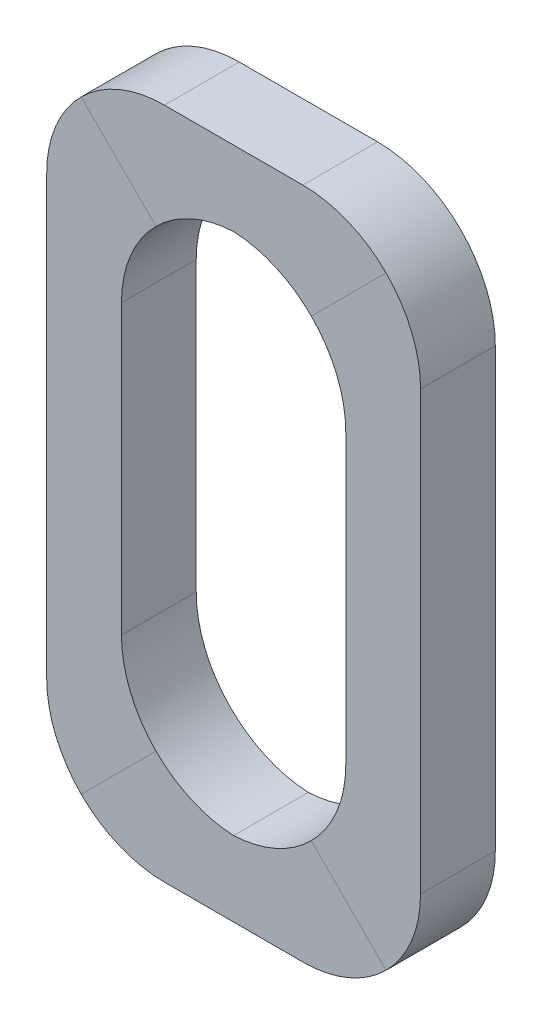
ISO-10303-21;
HEADER;
FILE_DESCRIPTION(('STEP AP214'),'2;1');
FILE_NAME('part.step','',(''),(''),'','','');
FILE_SCHEMA(('AUTOMOTIVE_DESIGN { 1 0 10303 214 1 1 1 1 }'));
ENDSEC;
DATA;
#1=APPLICATION_CONTEXT('core data for automotive mechanical design processes');
#2=APPLICATION_PROTOCOL_DEFINITION('international standard','automotive_design',2000,#1);
#3=PRODUCT_CONTEXT('',#1,'mechanical');
#4=PRODUCT('Part','Part','',(#3));
#5=PRODUCT_RELATED_PRODUCT_CATEGORY('part','',(#4));
#6=PRODUCT_DEFINITION_FORMATION('','',#4);
#7=PRODUCT_DEFINITION_CONTEXT('part definition',#1,'design');
#8=PRODUCT_DEFINITION('design','',#6,#7);
#9=PRODUCT_DEFINITION_SHAPE('','',#8);
#10=(LENGTH_UNIT() NAMED_UNIT(*) SI_UNIT(.MILLI.,.METRE.));
#11=(NAMED_UNIT(*) PLANE_ANGLE_UNIT() SI_UNIT($,.RADIAN.));
#12=(NAMED_UNIT(*) SI_UNIT($,.STERADIAN.) SOLID_ANGLE_UNIT());
#13=UNCERTAINTY_MEASURE_WITH_UNIT(LENGTH_MEASURE(1.E-05),#10,'distance_accuracy_value','');
#14=(GEOMETRIC_REPRESENTATION_CONTEXT(3) GLOBAL_UNCERTAINTY_ASSIGNED_CONTEXT((#13)) GLOBAL_UNIT_ASSIGNED_CONTEXT((#10,
#11,#12)) REPRESENTATION_CONTEXT('',''));
#15=CARTESIAN_POINT('',(0.,0.,0.));
#16=DIRECTION('',(0.,0.,1.));
#17=DIRECTION('',(1.,0.,0.));
#18=AXIS2_PLACEMENT_3D('',#15,#16,#17);
#19=CARTESIAN_POINT('',(28.575,54.3925,3.175));
#20=DIRECTION('',(0.,0.,1.));
#21=DIRECTION('',(1.,0.,0.));
#22=AXIS2_PLACEMENT_3D('',#19,#20,#21);
#23=PLANE('',#22);
#24=DIRECTION('',(0.707106781186548,-0.707106781186548,0.));
#25=VECTOR('',#24,1.);
#26=CARTESIAN_POINT('',(28.78375,-3.38374999999999,3.175));
#27=LINE('',#26,#25);
#28=CARTESIAN_POINT('',(19.2960678118655,6.10393218813454,3.175));
#29=VERTEX_POINT('',#28);
#30=CARTESIAN_POINT('',(25.6460678118655,-0.246067811865467,3.175));
#31=VERTEX_POINT('',#30);
#32=EDGE_CURVE('E251',#29,#31,#27,.T.);
#33=ORIENTED_EDGE('',*,*,#32,.T.);
#34=CARTESIAN_POINT('',(18.575,6.82500000000001,3.175));
#35=DIRECTION('',(0.,0.,1.));
#36=DIRECTION('',(1.,0.,0.));
#37=AXIS2_PLACEMENT_3D('',#34,#35,#36);
#38=CIRCLE('',#37,10.);
#39=CARTESIAN_POINT('',(28.575,6.82500000000001,3.175));
#40=VERTEX_POINT('',#39);
#41=EDGE_CURVE('E11',#31,#40,#38,.T.);
#42=ORIENTED_EDGE('',*,*,#41,.T.);
#43=DIRECTION('',(0.,-1.,0.));
#44=VECTOR('',#43,1.);
#45=CARTESIAN_POINT('',(28.575,54.3925,3.175));
#46=LINE('',#45,#44);
#47=CARTESIAN_POINT('',(28.575,43.975,3.175));
#48=VERTEX_POINT('',#47);
#49=EDGE_CURVE('E262',#48,#40,#46,.T.);
#50=ORIENTED_EDGE('',*,*,#49,.F.);
#51=CARTESIAN_POINT('',(18.575,43.975,3.175));
#52=DIRECTION('',(0.,0.,1.));
#53=DIRECTION('',(1.,0.,0.));
#54=AXIS2_PLACEMENT_3D('',#51,#52,#53);
#55=CIRCLE('',#54,10.);
#56=CARTESIAN_POINT('',(25.6460678118655,51.0460678118655,3.175));
#57=VERTEX_POINT('',#56);
#58=EDGE_CURVE('E47',#48,#57,#55,.T.);
#59=ORIENTED_EDGE('',*,*,#58,.T.);
#60=DIRECTION('',(0.707106781186548,0.707106781186548,0.));
#61=VECTOR('',#60,1.);
#62=CARTESIAN_POINT('',(12.49125,37.89125,3.175));
#63=LINE('',#62,#61);
#64=CARTESIAN_POINT('',(19.2960678118655,44.6960678118655,3.175));
#65=VERTEX_POINT('',#64);
#66=EDGE_CURVE('E234',#65,#57,#63,.T.);
#67=ORIENTED_EDGE('',*,*,#66,.F.);
#68=CARTESIAN_POINT('',(12.225,37.625,3.175));
#69=DIRECTION('',(0.,0.,1.));
#70=DIRECTION('',(1.,0.,0.));
#71=AXIS2_PLACEMENT_3D('',#68,#69,#70);
#72=CIRCLE('',#71,10.);
#73=CARTESIAN_POINT('',(22.225,37.625,3.175));
#74=VERTEX_POINT('',#73);
#75=EDGE_CURVE('E311',#65,#74,#72,.F.);
#76=ORIENTED_EDGE('',*,*,#75,.T.);
#77=DIRECTION('',(0.,-1.,0.));
#78=VECTOR('',#77,1.);
#79=CARTESIAN_POINT('',(22.225,54.3925,3.175));
#80=LINE('',#79,#78);
#81=CARTESIAN_POINT('',(22.225,13.175,3.175));
#82=VERTEX_POINT('',#81);
#83=EDGE_CURVE('E255',#74,#82,#80,.T.);
#84=ORIENTED_EDGE('',*,*,#83,.T.);
#85=CARTESIAN_POINT('',(12.225,13.175,3.175));
#86=DIRECTION('',(0.,0.,1.));
#87=DIRECTION('',(1.,0.,0.));
#88=AXIS2_PLACEMENT_3D('',#85,#86,#87);
#89=CIRCLE('',#88,10.);
#90=EDGE_CURVE('E293',#82,#29,#89,.F.);
#91=ORIENTED_EDGE('',*,*,#90,.T.);
#92=EDGE_LOOP('',(#33,#42,#50,#59,#67,#76,#84,#91));
#93=FACE_BOUND('',#92,.T.);
#94=ADVANCED_FACE('F38',(#93),#23,.T.);
#95=CARTESIAN_POINT('',(28.575,54.3925,3.175));
#96=DIRECTION('',(1.,0.,0.));
#97=DIRECTION('',(0.,0.,-1.));
#98=AXIS2_PLACEMENT_3D('',#95,#96,#97);
#99=PLANE('',#98);
#100=ORIENTED_EDGE('',*,*,#49,.T.);
#101=DIRECTION('',(0.,0.,-1.));
#102=VECTOR('',#101,1.);
#103=CARTESIAN_POINT('',(28.575,6.82500000000001,3.175));
#104=LINE('',#103,#102);
#105=CARTESIAN_POINT('',(28.575,6.82500000000001,-3.175));
#106=VERTEX_POINT('',#105);
#107=EDGE_CURVE('E400',#40,#106,#104,.T.);
#108=ORIENTED_EDGE('',*,*,#107,.T.);
#109=DIRECTION('',(0.,-1.,0.));
#110=VECTOR('',#109,1.);
#111=CARTESIAN_POINT('',(28.575,54.3925,-3.175));
#112=LINE('',#111,#110);
#113=CARTESIAN_POINT('',(28.575,43.975,-3.175));
#114=VERTEX_POINT('',#113);
#115=EDGE_CURVE('E266',#114,#106,#112,.T.);
#116=ORIENTED_EDGE('',*,*,#115,.F.);
#117=DIRECTION('',(0.,0.,-1.));
#118=VECTOR('',#117,1.);
#119=CARTESIAN_POINT('',(28.575,43.975,3.175));
#120=LINE('',#119,#118);
#121=EDGE_CURVE('E397',#114,#48,#120,.F.);
#122=ORIENTED_EDGE('',*,*,#121,.T.);
#123=EDGE_LOOP('',(#100,#108,#116,#122));
#124=FACE_BOUND('',#123,.T.);
#125=ADVANCED_FACE('F496',(#124),#99,.T.);
#126=CARTESIAN_POINT('',(28.575,54.3925,-3.175));
#127=DIRECTION('',(0.,0.,-1.));
#128=DIRECTION('',(-1.,0.,0.));
#129=AXIS2_PLACEMENT_3D('',#126,#127,#128);
#130=PLANE('',#129);
#131=ORIENTED_EDGE('',*,*,#115,.T.);
#132=CARTESIAN_POINT('',(18.575,6.82500000000001,-3.175));
#133=DIRECTION('',(0.,0.,-1.));
#134=DIRECTION('',(-1.,0.,0.));
#135=AXIS2_PLACEMENT_3D('',#132,#133,#134);
#136=CIRCLE('',#135,10.);
#137=CARTESIAN_POINT('',(25.6460678118655,-0.246067811865467,-3.175));
#138=VERTEX_POINT('',#137);
#139=EDGE_CURVE('E54',#106,#138,#136,.T.);
#140=ORIENTED_EDGE('',*,*,#139,.T.);
#141=DIRECTION('',(-0.707106781186548,0.707106781186548,0.));
#142=VECTOR('',#141,1.);
#143=CARTESIAN_POINT('',(28.78375,-3.38374999999999,-3.175));
#144=LINE('',#143,#142);
#145=CARTESIAN_POINT('',(19.2960678118655,6.10393218813454,-3.175));
#146=VERTEX_POINT('',#145);
#147=EDGE_CURVE('E247',#138,#146,#144,.T.);
#148=ORIENTED_EDGE('',*,*,#147,.T.);
#149=CARTESIAN_POINT('',(12.225,13.175,-3.175));
#150=DIRECTION('',(0.,0.,-1.));
#151=DIRECTION('',(-1.,0.,0.));
#152=AXIS2_PLACEMENT_3D('',#149,#150,#151);
#153=CIRCLE('',#152,10.);
#154=CARTESIAN_POINT('',(22.225,13.175,-3.175));
#155=VERTEX_POINT('',#154);
#156=EDGE_CURVE('E304',#146,#155,#153,.F.);
#157=ORIENTED_EDGE('',*,*,#156,.T.);
#158=DIRECTION('',(0.,-1.,0.));
#159=VECTOR('',#158,1.);
#160=CARTESIAN_POINT('',(22.225,54.3925,-3.175));
#161=LINE('',#160,#159);
#162=CARTESIAN_POINT('',(22.225,37.625,-3.175));
#163=VERTEX_POINT('',#162);
#164=EDGE_CURVE('E270',#163,#155,#161,.T.);
#165=ORIENTED_EDGE('',*,*,#164,.F.);
#166=CARTESIAN_POINT('',(12.225,37.625,-3.175));
#167=DIRECTION('',(0.,0.,-1.));
#168=DIRECTION('',(-1.,0.,0.));
#169=AXIS2_PLACEMENT_3D('',#166,#167,#168);
#170=CIRCLE('',#169,10.);
#171=CARTESIAN_POINT('',(19.2960678118655,44.6960678118655,-3.175));
#172=VERTEX_POINT('',#171);
#173=EDGE_CURVE('E314',#163,#172,#170,.F.);
#174=ORIENTED_EDGE('',*,*,#173,.T.);
#175=DIRECTION('',(-0.707106781186548,-0.707106781186548,0.));
#176=VECTOR('',#175,1.);
#177=CARTESIAN_POINT('',(12.49125,37.89125,-3.175));
#178=LINE('',#177,#176);
#179=CARTESIAN_POINT('',(25.6460678118655,51.0460678118655,-3.175));
#180=VERTEX_POINT('',#179);
#181=EDGE_CURVE('E230',#180,#172,#178,.T.);
#182=ORIENTED_EDGE('',*,*,#181,.F.);
#183=CARTESIAN_POINT('',(18.575,43.975,-3.175));
#184=DIRECTION('',(0.,0.,-1.));
#185=DIRECTION('',(-1.,0.,0.));
#186=AXIS2_PLACEMENT_3D('',#183,#184,#185);
#187=CIRCLE('',#186,10.);
#188=EDGE_CURVE('E62',#180,#114,#187,.T.);
#189=ORIENTED_EDGE('',*,*,#188,.T.);
#190=EDGE_LOOP('',(#131,#140,#148,#157,#165,#174,#182,#189));
#191=FACE_BOUND('',#190,.T.);
#192=ADVANCED_FACE('F494',(#191),#130,.T.);
#193=CARTESIAN_POINT('',(22.225,54.3925,3.175));
#194=DIRECTION('',(-1.,0.,0.));
#195=DIRECTION('',(0.,0.,1.));
#196=AXIS2_PLACEMENT_3D('',#193,#194,#195);
#197=PLANE('',#196);
#198=ORIENTED_EDGE('',*,*,#164,.T.);
#199=DIRECTION('',(0.,0.,1.));
#200=VECTOR('',#199,1.);
#201=CARTESIAN_POINT('',(22.225,13.175,3.175));
#202=LINE('',#201,#200);
#203=EDGE_CURVE('E282',#155,#82,#202,.T.);
#204=ORIENTED_EDGE('',*,*,#203,.T.);
#205=ORIENTED_EDGE('',*,*,#83,.F.);
#206=DIRECTION('',(0.,0.,1.));
#207=VECTOR('',#206,1.);
#208=CARTESIAN_POINT('',(22.225,37.625,-3.175));
#209=LINE('',#208,#207);
#210=EDGE_CURVE('E213',#74,#163,#209,.F.);
#211=ORIENTED_EDGE('',*,*,#210,.T.);
#212=EDGE_LOOP('',(#198,#204,#205,#211));
#213=FACE_BOUND('',#212,.T.);
#214=ADVANCED_FACE('F491',(#213),#197,.T.);
#215=CARTESIAN_POINT('',(28.9925,-3.17499999999999,3.175));
#216=DIRECTION('',(0.,0.,1.));
#217=DIRECTION('',(1.,0.,0.));
#218=AXIS2_PLACEMENT_3D('',#215,#216,#217);
#219=PLANE('',#218);
#220=DIRECTION('',(-0.707106781186548,-0.707106781186548,0.));
#221=VECTOR('',#220,1.);
#222=CARTESIAN_POINT('',(-3.38375,-3.38375,3.175));
#223=LINE('',#222,#221);
#224=CARTESIAN_POINT('',(6.10393218813453,6.10393218813453,3.175));
#225=VERTEX_POINT('',#224);
#226=CARTESIAN_POINT('',(-0.246067811865472,-0.246067811865471,3.175));
#227=VERTEX_POINT('',#226);
#228=EDGE_CURVE('E233',#225,#227,#223,.T.);
#229=ORIENTED_EDGE('',*,*,#228,.T.);
#230=CARTESIAN_POINT('',(6.825,6.82500000000001,3.175));
#231=DIRECTION('',(0.,0.,1.));
#232=DIRECTION('',(1.,0.,0.));
#233=AXIS2_PLACEMENT_3D('',#230,#231,#232);
#234=CIRCLE('',#233,10.);
#235=CARTESIAN_POINT('',(6.825,-3.17499999999999,3.175));
#236=VERTEX_POINT('',#235);
#237=EDGE_CURVE('E394',#227,#236,#234,.T.);
#238=ORIENTED_EDGE('',*,*,#237,.T.);
#239=DIRECTION('',(-1.,0.,0.));
#240=VECTOR('',#239,1.);
#241=CARTESIAN_POINT('',(28.9925,-3.17499999999999,3.175));
#242=LINE('',#241,#240);
#243=CARTESIAN_POINT('',(18.575,-3.17499999999999,3.175));
#244=VERTEX_POINT('',#243);
#245=EDGE_CURVE('E250',#244,#236,#242,.T.);
#246=ORIENTED_EDGE('',*,*,#245,.F.);
#247=CARTESIAN_POINT('',(18.575,6.82500000000001,3.175));
#248=DIRECTION('',(0.,0.,1.));
#249=DIRECTION('',(1.,0.,0.));
#250=AXIS2_PLACEMENT_3D('',#247,#248,#249);
#251=CIRCLE('',#250,10.);
#252=EDGE_CURVE('E391',#244,#31,#251,.T.);
#253=ORIENTED_EDGE('',*,*,#252,.T.);
#254=ORIENTED_EDGE('',*,*,#32,.F.);
#255=CARTESIAN_POINT('',(12.225,13.175,3.175));
#256=DIRECTION('',(0.,0.,1.));
#257=DIRECTION('',(1.,0.,0.));
#258=AXIS2_PLACEMENT_3D('',#255,#256,#257);
#259=CIRCLE('',#258,10.);
#260=CARTESIAN_POINT('',(12.6999999999999,3.18628762051886,3.175));
#261=VERTEX_POINT('',#260);
#262=EDGE_CURVE('E297',#29,#261,#259,.F.);
#263=ORIENTED_EDGE('',*,*,#262,.T.);
#264=CARTESIAN_POINT('',(13.175,13.175,3.175));
#265=DIRECTION('',(0.,0.,1.));
#266=DIRECTION('',(1.,0.,0.));
#267=AXIS2_PLACEMENT_3D('',#264,#265,#266);
#268=CIRCLE('',#267,10.);
#269=EDGE_CURVE('E285',#261,#225,#268,.F.);
#270=ORIENTED_EDGE('',*,*,#269,.T.);
#271=EDGE_LOOP('',(#229,#238,#246,#253,#254,#263,#270));
#272=FACE_BOUND('',#271,.T.);
#273=ADVANCED_FACE('F470',(#272),#219,.T.);
#274=CARTESIAN_POINT('',(28.9925,-3.17499999999999,3.175));
#275=DIRECTION('',(0.,-1.,0.));
#276=DIRECTION('',(0.,0.,-1.));
#277=AXIS2_PLACEMENT_3D('',#274,#275,#276);
#278=PLANE('',#277);
#279=ORIENTED_EDGE('',*,*,#245,.T.);
#280=DIRECTION('',(0.,0.,-1.));
#281=VECTOR('',#280,1.);
#282=CARTESIAN_POINT('',(6.825,-3.17499999999999,3.175));
#283=LINE('',#282,#281);
#284=CARTESIAN_POINT('',(6.825,-3.17499999999999,-3.175));
#285=VERTEX_POINT('',#284);
#286=EDGE_CURVE('E381',#236,#285,#283,.T.);
#287=ORIENTED_EDGE('',*,*,#286,.T.);
#288=DIRECTION('',(-1.,0.,0.));
#289=VECTOR('',#288,1.);
#290=CARTESIAN_POINT('',(28.9925,-3.17499999999999,-3.175));
#291=LINE('',#290,#289);
#292=CARTESIAN_POINT('',(18.575,-3.17499999999999,-3.175));
#293=VERTEX_POINT('',#292);
#294=EDGE_CURVE('E243',#293,#285,#291,.T.);
#295=ORIENTED_EDGE('',*,*,#294,.F.);
#296=DIRECTION('',(0.,0.,-1.));
#297=VECTOR('',#296,1.);
#298=CARTESIAN_POINT('',(18.575,-3.17499999999999,3.175));
#299=LINE('',#298,#297);
#300=EDGE_CURVE('E378',#293,#244,#299,.F.);
#301=ORIENTED_EDGE('',*,*,#300,.T.);
#302=EDGE_LOOP('',(#279,#287,#295,#301));
#303=FACE_BOUND('',#302,.T.);
#304=ADVANCED_FACE('F484',(#303),#278,.T.);
#305=CARTESIAN_POINT('',(28.9925,-3.17499999999999,-3.175));
#306=DIRECTION('',(0.,0.,-1.));
#307=DIRECTION('',(-1.,0.,0.));
#308=AXIS2_PLACEMENT_3D('',#305,#306,#307);
#309=PLANE('',#308);
#310=ORIENTED_EDGE('',*,*,#294,.T.);
#311=CARTESIAN_POINT('',(6.825,6.82500000000001,-3.175));
#312=DIRECTION('',(0.,0.,-1.));
#313=DIRECTION('',(-1.,0.,0.));
#314=AXIS2_PLACEMENT_3D('',#311,#312,#313);
#315=CIRCLE('',#314,10.);
#316=CARTESIAN_POINT('',(-0.246067811865472,-0.246067811865471,-3.175));
#317=VERTEX_POINT('',#316);
#318=EDGE_CURVE('E388',#285,#317,#315,.T.);
#319=ORIENTED_EDGE('',*,*,#318,.T.);
#320=DIRECTION('',(0.707106781186548,0.707106781186548,0.));
#321=VECTOR('',#320,1.);
#322=CARTESIAN_POINT('',(-3.38375,-3.38375,-3.175));
#323=LINE('',#322,#321);
#324=CARTESIAN_POINT('',(6.10393218813453,6.10393218813453,-3.175));
#325=VERTEX_POINT('',#324);
#326=EDGE_CURVE('E448',#317,#325,#323,.T.);
#327=ORIENTED_EDGE('',*,*,#326,.T.);
#328=CARTESIAN_POINT('',(13.175,13.175,-3.175));
#329=DIRECTION('',(0.,0.,-1.));
#330=DIRECTION('',(-1.,0.,0.));
#331=AXIS2_PLACEMENT_3D('',#328,#329,#330);
#332=CIRCLE('',#331,10.);
#333=CARTESIAN_POINT('',(12.6999999999999,3.18628762051886,-3.175));
#334=VERTEX_POINT('',#333);
#335=EDGE_CURVE('E197',#325,#334,#332,.F.);
#336=ORIENTED_EDGE('',*,*,#335,.T.);
#337=CARTESIAN_POINT('',(12.225,13.175,-3.175));
#338=DIRECTION('',(0.,0.,-1.));
#339=DIRECTION('',(-1.,0.,0.));
#340=AXIS2_PLACEMENT_3D('',#337,#338,#339);
#341=CIRCLE('',#340,10.);
#342=EDGE_CURVE('E300',#334,#146,#341,.F.);
#343=ORIENTED_EDGE('',*,*,#342,.T.);
#344=ORIENTED_EDGE('',*,*,#147,.F.);
#345=CARTESIAN_POINT('',(18.575,6.82500000000001,-3.175));
#346=DIRECTION('',(0.,0.,-1.));
#347=DIRECTION('',(-1.,0.,0.));
#348=AXIS2_PLACEMENT_3D('',#345,#346,#347);
#349=CIRCLE('',#348,10.);
#350=EDGE_CURVE('E385',#138,#293,#349,.T.);
#351=ORIENTED_EDGE('',*,*,#350,.T.);
#352=EDGE_LOOP('',(#310,#319,#327,#336,#343,#344,#351));
#353=FACE_BOUND('',#352,.T.);
#354=ADVANCED_FACE('F480',(#353),#309,.T.);
#355=CARTESIAN_POINT('',(-3.59249999999999,53.975,3.175));
#356=DIRECTION('',(0.,0.,1.));
#357=DIRECTION('',(1.,0.,0.));
#358=AXIS2_PLACEMENT_3D('',#355,#356,#357);
#359=PLANE('',#358);
#360=DIRECTION('',(1.,0.,0.));
#361=VECTOR('',#360,1.);
#362=CARTESIAN_POINT('',(-3.59249999999999,53.975,3.175));
#363=LINE('',#362,#361);
#364=CARTESIAN_POINT('',(6.825,53.975,3.175));
#365=VERTEX_POINT('',#364);
#366=CARTESIAN_POINT('',(18.575,53.975,3.175));
#367=VERTEX_POINT('',#366);
#368=EDGE_CURVE('E239',#365,#367,#363,.T.);
#369=ORIENTED_EDGE('',*,*,#368,.F.);
#370=CARTESIAN_POINT('',(6.825,43.975,3.175));
#371=DIRECTION('',(0.,0.,1.));
#372=DIRECTION('',(1.,0.,0.));
#373=AXIS2_PLACEMENT_3D('',#370,#371,#372);
#374=CIRCLE('',#373,10.);
#375=CARTESIAN_POINT('',(-0.24606781186548,51.0460678118655,3.175));
#376=VERTEX_POINT('',#375);
#377=EDGE_CURVE('E369',#365,#376,#374,.T.);
#378=ORIENTED_EDGE('',*,*,#377,.T.);
#379=DIRECTION('',(-0.707106781186548,0.707106781186548,0.));
#380=VECTOR('',#379,1.);
#381=CARTESIAN_POINT('',(25.60875,25.19125,3.175));
#382=LINE('',#381,#380);
#383=CARTESIAN_POINT('',(6.10393218813452,44.6960678118655,3.175));
#384=VERTEX_POINT('',#383);
#385=EDGE_CURVE('E434',#384,#376,#382,.T.);
#386=ORIENTED_EDGE('',*,*,#385,.F.);
#387=CARTESIAN_POINT('',(13.175,37.625,3.175));
#388=DIRECTION('',(0.,0.,1.));
#389=DIRECTION('',(1.,0.,0.));
#390=AXIS2_PLACEMENT_3D('',#387,#388,#389);
#391=CIRCLE('',#390,10.);
#392=CARTESIAN_POINT('',(12.7,47.6137123794811,3.175));
#393=VERTEX_POINT('',#392);
#394=EDGE_CURVE('E325',#384,#393,#391,.F.);
#395=ORIENTED_EDGE('',*,*,#394,.T.);
#396=CARTESIAN_POINT('',(12.225,37.625,3.175));
#397=DIRECTION('',(0.,0.,1.));
#398=DIRECTION('',(1.,0.,0.));
#399=AXIS2_PLACEMENT_3D('',#396,#397,#398);
#400=CIRCLE('',#399,10.);
#401=EDGE_CURVE('E307',#393,#65,#400,.F.);
#402=ORIENTED_EDGE('',*,*,#401,.T.);
#403=ORIENTED_EDGE('',*,*,#66,.T.);
#404=CARTESIAN_POINT('',(18.575,43.975,3.175));
#405=DIRECTION('',(0.,0.,1.));
#406=DIRECTION('',(1.,0.,0.));
#407=AXIS2_PLACEMENT_3D('',#404,#405,#406);
#408=CIRCLE('',#407,10.);
#409=EDGE_CURVE('E366',#57,#367,#408,.T.);
#410=ORIENTED_EDGE('',*,*,#409,.T.);
#411=EDGE_LOOP('',(#369,#378,#386,#395,#402,#403,#410));
#412=FACE_BOUND('',#411,.T.);
#413=ADVANCED_FACE('F415',(#412),#359,.T.);
#414=CARTESIAN_POINT('',(-3.59249999999999,53.975,3.175));
#415=DIRECTION('',(0.,1.,0.));
#416=DIRECTION('',(0.,0.,1.));
#417=AXIS2_PLACEMENT_3D('',#414,#415,#416);
#418=PLANE('',#417);
#419=DIRECTION('',(1.,0.,0.));
#420=VECTOR('',#419,1.);
#421=CARTESIAN_POINT('',(-3.59249999999999,53.975,-3.175));
#422=LINE('',#421,#420);
#423=CARTESIAN_POINT('',(6.825,53.975,-3.175));
#424=VERTEX_POINT('',#423);
#425=CARTESIAN_POINT('',(18.575,53.975,-3.175));
#426=VERTEX_POINT('',#425);
#427=EDGE_CURVE('E238',#424,#426,#422,.T.);
#428=ORIENTED_EDGE('',*,*,#427,.F.);
#429=DIRECTION('',(0.,0.,-1.));
#430=VECTOR('',#429,1.);
#431=CARTESIAN_POINT('',(6.825,53.975,3.175));
#432=LINE('',#431,#430);
#433=EDGE_CURVE('E363',#424,#365,#432,.F.);
#434=ORIENTED_EDGE('',*,*,#433,.T.);
#435=ORIENTED_EDGE('',*,*,#368,.T.);
#436=DIRECTION('',(0.,0.,-1.));
#437=VECTOR('',#436,1.);
#438=CARTESIAN_POINT('',(18.575,53.975,3.175));
#439=LINE('',#438,#437);
#440=EDGE_CURVE('E359',#367,#426,#439,.T.);
#441=ORIENTED_EDGE('',*,*,#440,.T.);
#442=EDGE_LOOP('',(#428,#434,#435,#441));
#443=FACE_BOUND('',#442,.T.);
#444=ADVANCED_FACE('F421',(#443),#418,.T.);
#445=CARTESIAN_POINT('',(-3.59249999999999,53.975,-3.175));
#446=DIRECTION('',(0.,0.,-1.));
#447=DIRECTION('',(-1.,0.,0.));
#448=AXIS2_PLACEMENT_3D('',#445,#446,#447);
#449=PLANE('',#448);
#450=DIRECTION('',(0.707106781186548,-0.707106781186548,0.));
#451=VECTOR('',#450,1.);
#452=CARTESIAN_POINT('',(25.60875,25.19125,-3.175));
#453=LINE('',#452,#451);
#454=CARTESIAN_POINT('',(-0.24606781186548,51.0460678118655,-3.175));
#455=VERTEX_POINT('',#454);
#456=CARTESIAN_POINT('',(6.10393218813452,44.6960678118655,-3.175));
#457=VERTEX_POINT('',#456);
#458=EDGE_CURVE('E427',#455,#457,#453,.T.);
#459=ORIENTED_EDGE('',*,*,#458,.F.);
#460=CARTESIAN_POINT('',(6.825,43.975,-3.175));
#461=DIRECTION('',(0.,0.,-1.));
#462=DIRECTION('',(-1.,0.,0.));
#463=AXIS2_PLACEMENT_3D('',#460,#461,#462);
#464=CIRCLE('',#463,10.);
#465=EDGE_CURVE('E356',#455,#424,#464,.T.);
#466=ORIENTED_EDGE('',*,*,#465,.T.);
#467=ORIENTED_EDGE('',*,*,#427,.T.);
#468=CARTESIAN_POINT('',(18.575,43.975,-3.175));
#469=DIRECTION('',(0.,0.,-1.));
#470=DIRECTION('',(-1.,0.,0.));
#471=AXIS2_PLACEMENT_3D('',#468,#469,#470);
#472=CIRCLE('',#471,10.);
#473=EDGE_CURVE('E353',#426,#180,#472,.T.);
#474=ORIENTED_EDGE('',*,*,#473,.T.);
#475=ORIENTED_EDGE('',*,*,#181,.T.);
#476=CARTESIAN_POINT('',(12.225,37.625,-3.175));
#477=DIRECTION('',(0.,0.,-1.));
#478=DIRECTION('',(-1.,0.,0.));
#479=AXIS2_PLACEMENT_3D('',#476,#477,#478);
#480=CIRCLE('',#479,10.);
#481=CARTESIAN_POINT('',(12.7,47.6137123794811,-3.175));
#482=VERTEX_POINT('',#481);
#483=EDGE_CURVE('E318',#172,#482,#480,.F.);
#484=ORIENTED_EDGE('',*,*,#483,.T.);
#485=CARTESIAN_POINT('',(13.175,37.625,-3.175));
#486=DIRECTION('',(0.,0.,-1.));
#487=DIRECTION('',(-1.,0.,0.));
#488=AXIS2_PLACEMENT_3D('',#485,#486,#487);
#489=CIRCLE('',#488,10.);
#490=EDGE_CURVE('E328',#482,#457,#489,.F.);
#491=ORIENTED_EDGE('',*,*,#490,.T.);
#492=EDGE_LOOP('',(#459,#466,#467,#474,#475,#484,#491));
#493=FACE_BOUND('',#492,.T.);
#494=ADVANCED_FACE('F425',(#493),#449,.T.);
#495=CARTESIAN_POINT('',(-3.175,-3.5925,3.175));
#496=DIRECTION('',(0.,0.,1.));
#497=DIRECTION('',(1.,0.,0.));
#498=AXIS2_PLACEMENT_3D('',#495,#496,#497);
#499=PLANE('',#498);
#500=ORIENTED_EDGE('',*,*,#385,.T.);
#501=CARTESIAN_POINT('',(6.825,43.975,3.175));
#502=DIRECTION('',(0.,0.,1.));
#503=DIRECTION('',(1.,0.,0.));
#504=AXIS2_PLACEMENT_3D('',#501,#502,#503);
#505=CIRCLE('',#504,10.);
#506=CARTESIAN_POINT('',(-3.175,43.975,3.175));
#507=VERTEX_POINT('',#506);
#508=EDGE_CURVE('E375',#376,#507,#505,.T.);
#509=ORIENTED_EDGE('',*,*,#508,.T.);
#510=DIRECTION('',(0.,1.,0.));
#511=VECTOR('',#510,1.);
#512=CARTESIAN_POINT('',(-3.175,-3.5925,3.175));
#513=LINE('',#512,#511);
#514=CARTESIAN_POINT('',(-3.175,6.82500000000001,3.175));
#515=VERTEX_POINT('',#514);
#516=EDGE_CURVE('E226',#515,#507,#513,.T.);
#517=ORIENTED_EDGE('',*,*,#516,.F.);
#518=CARTESIAN_POINT('',(6.825,6.82500000000001,3.175));
#519=DIRECTION('',(0.,0.,1.));
#520=DIRECTION('',(1.,0.,0.));
#521=AXIS2_PLACEMENT_3D('',#518,#519,#520);
#522=CIRCLE('',#521,10.);
#523=EDGE_CURVE('E372',#515,#227,#522,.T.);
#524=ORIENTED_EDGE('',*,*,#523,.T.);
#525=ORIENTED_EDGE('',*,*,#228,.F.);
#526=CARTESIAN_POINT('',(13.175,13.175,3.175));
#527=DIRECTION('',(0.,0.,1.));
#528=DIRECTION('',(1.,0.,0.));
#529=AXIS2_PLACEMENT_3D('',#526,#527,#528);
#530=CIRCLE('',#529,10.);
#531=CARTESIAN_POINT('',(3.175,13.175,3.175));
#532=VERTEX_POINT('',#531);
#533=EDGE_CURVE('E202',#225,#532,#530,.F.);
#534=ORIENTED_EDGE('',*,*,#533,.T.);
#535=DIRECTION('',(0.,1.,0.));
#536=VECTOR('',#535,1.);
#537=CARTESIAN_POINT('',(3.175,-3.5925,3.175));
#538=LINE('',#537,#536);
#539=CARTESIAN_POINT('',(3.175,37.625,3.175));
#540=VERTEX_POINT('',#539);
#541=EDGE_CURVE('E211',#532,#540,#538,.T.);
#542=ORIENTED_EDGE('',*,*,#541,.T.);
#543=CARTESIAN_POINT('',(13.175,37.625,3.175));
#544=DIRECTION('',(0.,0.,1.));
#545=DIRECTION('',(1.,0.,0.));
#546=AXIS2_PLACEMENT_3D('',#543,#544,#545);
#547=CIRCLE('',#546,10.);
#548=EDGE_CURVE('E321',#540,#384,#547,.F.);
#549=ORIENTED_EDGE('',*,*,#548,.T.);
#550=EDGE_LOOP('',(#500,#509,#517,#524,#525,#534,#542,#549));
#551=FACE_BOUND('',#550,.T.);
#552=ADVANCED_FACE('F436',(#551),#499,.T.);
#553=CARTESIAN_POINT('',(-3.175,-3.5925,3.175));
#554=DIRECTION('',(-1.,0.,0.));
#555=DIRECTION('',(0.,0.,1.));
#556=AXIS2_PLACEMENT_3D('',#553,#554,#555);
#557=PLANE('',#556);
#558=ORIENTED_EDGE('',*,*,#516,.T.);
#559=DIRECTION('',(0.,0.,-1.));
#560=VECTOR('',#559,1.);
#561=CARTESIAN_POINT('',(-3.175,43.975,3.175));
#562=LINE('',#561,#560);
#563=CARTESIAN_POINT('',(-3.175,43.975,-3.175));
#564=VERTEX_POINT('',#563);
#565=EDGE_CURVE('E343',#507,#564,#562,.T.);
#566=ORIENTED_EDGE('',*,*,#565,.T.);
#567=DIRECTION('',(0.,1.,0.));
#568=VECTOR('',#567,1.);
#569=CARTESIAN_POINT('',(-3.175,-3.5925,-3.175));
#570=LINE('',#569,#568);
#571=CARTESIAN_POINT('',(-3.175,6.82500000000001,-3.175));
#572=VERTEX_POINT('',#571);
#573=EDGE_CURVE('E221',#572,#564,#570,.T.);
#574=ORIENTED_EDGE('',*,*,#573,.F.);
#575=DIRECTION('',(0.,0.,-1.));
#576=VECTOR('',#575,1.);
#577=CARTESIAN_POINT('',(-3.175,6.82500000000001,3.175));
#578=LINE('',#577,#576);
#579=EDGE_CURVE('E334',#572,#515,#578,.F.);
#580=ORIENTED_EDGE('',*,*,#579,.T.);
#581=EDGE_LOOP('',(#558,#566,#574,#580));
#582=FACE_BOUND('',#581,.T.);
#583=ADVANCED_FACE('F445',(#582),#557,.T.);
#584=CARTESIAN_POINT('',(-3.175,-3.5925,-3.175));
#585=DIRECTION('',(0.,0.,-1.));
#586=DIRECTION('',(-1.,0.,0.));
#587=AXIS2_PLACEMENT_3D('',#584,#585,#586);
#588=PLANE('',#587);
#589=ORIENTED_EDGE('',*,*,#573,.T.);
#590=CARTESIAN_POINT('',(6.825,43.975,-3.175));
#591=DIRECTION('',(0.,0.,-1.));
#592=DIRECTION('',(-1.,0.,0.));
#593=AXIS2_PLACEMENT_3D('',#590,#591,#592);
#594=CIRCLE('',#593,10.);
#595=EDGE_CURVE('E350',#564,#455,#594,.T.);
#596=ORIENTED_EDGE('',*,*,#595,.T.);
#597=ORIENTED_EDGE('',*,*,#458,.T.);
#598=CARTESIAN_POINT('',(13.175,37.625,-3.175));
#599=DIRECTION('',(0.,0.,-1.));
#600=DIRECTION('',(-1.,0.,0.));
#601=AXIS2_PLACEMENT_3D('',#598,#599,#600);
#602=CIRCLE('',#601,10.);
#603=CARTESIAN_POINT('',(3.175,37.625,-3.175));
#604=VERTEX_POINT('',#603);
#605=EDGE_CURVE('E219',#457,#604,#602,.F.);
#606=ORIENTED_EDGE('',*,*,#605,.T.);
#607=DIRECTION('',(0.,1.,0.));
#608=VECTOR('',#607,1.);
#609=CARTESIAN_POINT('',(3.175,-3.5925,-3.175));
#610=LINE('',#609,#608);
#611=CARTESIAN_POINT('',(3.175,13.175,-3.175));
#612=VERTEX_POINT('',#611);
#613=EDGE_CURVE('E208',#612,#604,#610,.T.);
#614=ORIENTED_EDGE('',*,*,#613,.F.);
#615=CARTESIAN_POINT('',(13.175,13.175,-3.175));
#616=DIRECTION('',(0.,0.,-1.));
#617=DIRECTION('',(-1.,0.,0.));
#618=AXIS2_PLACEMENT_3D('',#615,#616,#617);
#619=CIRCLE('',#618,10.);
#620=EDGE_CURVE('E191',#612,#325,#619,.F.);
#621=ORIENTED_EDGE('',*,*,#620,.T.);
#622=ORIENTED_EDGE('',*,*,#326,.F.);
#623=CARTESIAN_POINT('',(6.825,6.82500000000001,-3.175));
#624=DIRECTION('',(0.,0.,-1.));
#625=DIRECTION('',(-1.,0.,0.));
#626=AXIS2_PLACEMENT_3D('',#623,#624,#625);
#627=CIRCLE('',#626,10.);
#628=EDGE_CURVE('E347',#317,#572,#627,.T.);
#629=ORIENTED_EDGE('',*,*,#628,.T.);
#630=EDGE_LOOP('',(#589,#596,#597,#606,#614,#621,#622,#629));
#631=FACE_BOUND('',#630,.T.);
#632=ADVANCED_FACE('F217',(#631),#588,.T.);
#633=CARTESIAN_POINT('',(3.175,-3.5925,3.175));
#634=DIRECTION('',(1.,0.,0.));
#635=DIRECTION('',(0.,0.,-1.));
#636=AXIS2_PLACEMENT_3D('',#633,#634,#635);
#637=PLANE('',#636);
#638=ORIENTED_EDGE('',*,*,#541,.F.);
#639=DIRECTION('',(0.,0.,1.));
#640=VECTOR('',#639,1.);
#641=CARTESIAN_POINT('',(3.175,13.175,-3.175));
#642=LINE('',#641,#640);
#643=EDGE_CURVE('E195',#532,#612,#642,.F.);
#644=ORIENTED_EDGE('',*,*,#643,.T.);
#645=ORIENTED_EDGE('',*,*,#613,.T.);
#646=DIRECTION('',(0.,0.,1.));
#647=VECTOR('',#646,1.);
#648=CARTESIAN_POINT('',(3.175,37.625,3.175));
#649=LINE('',#648,#647);
#650=EDGE_CURVE('E214',#604,#540,#649,.T.);
#651=ORIENTED_EDGE('',*,*,#650,.T.);
#652=EDGE_LOOP('',(#638,#644,#645,#651));
#653=FACE_BOUND('',#652,.T.);
#654=ADVANCED_FACE('F207',(#653),#637,.T.);
#655=CARTESIAN_POINT('',(12.225,13.175,3.175));
#656=DIRECTION('',(0.,0.,-1.));
#657=DIRECTION('',(-1.,0.,0.));
#658=AXIS2_PLACEMENT_3D('',#655,#656,#657);
#659=CYLINDRICAL_SURFACE('',#658,10.);
#660=ORIENTED_EDGE('',*,*,#156,.F.);
#661=ORIENTED_EDGE('',*,*,#342,.F.);
#662=DIRECTION('',(0.,0.,-1.));
#663=VECTOR('',#662,1.);
#664=CARTESIAN_POINT('',(12.6999999999999,3.18628762051886,0.));
#665=LINE('',#664,#663);
#666=EDGE_CURVE('E267',#261,#334,#665,.T.);
#667=ORIENTED_EDGE('',*,*,#666,.F.);
#668=ORIENTED_EDGE('',*,*,#262,.F.);
#669=ORIENTED_EDGE('',*,*,#90,.F.);
#670=ORIENTED_EDGE('',*,*,#203,.F.);
#671=EDGE_LOOP('',(#660,#661,#667,#668,#669,#670));
#672=FACE_BOUND('',#671,.T.);
#673=ADVANCED_FACE('F476',(#672),#659,.F.);
#674=CARTESIAN_POINT('',(13.175,13.175,3.175));
#675=DIRECTION('',(0.,0.,-1.));
#676=DIRECTION('',(-1.,0.,0.));
#677=AXIS2_PLACEMENT_3D('',#674,#675,#676);
#678=CYLINDRICAL_SURFACE('',#677,10.);
#679=ORIENTED_EDGE('',*,*,#620,.F.);
#680=ORIENTED_EDGE('',*,*,#643,.F.);
#681=ORIENTED_EDGE('',*,*,#533,.F.);
#682=ORIENTED_EDGE('',*,*,#269,.F.);
#683=ORIENTED_EDGE('',*,*,#666,.T.);
#684=ORIENTED_EDGE('',*,*,#335,.F.);
#685=EDGE_LOOP('',(#679,#680,#681,#682,#683,#684));
#686=FACE_BOUND('',#685,.T.);
#687=ADVANCED_FACE('F193',(#686),#678,.F.);
#688=CARTESIAN_POINT('',(13.175,37.625,3.175));
#689=DIRECTION('',(0.,0.,-1.));
#690=DIRECTION('',(-1.,0.,0.));
#691=AXIS2_PLACEMENT_3D('',#688,#689,#690);
#692=CYLINDRICAL_SURFACE('',#691,10.);
#693=ORIENTED_EDGE('',*,*,#605,.F.);
#694=ORIENTED_EDGE('',*,*,#490,.F.);
#695=DIRECTION('',(0.,0.,-1.));
#696=VECTOR('',#695,1.);
#697=CARTESIAN_POINT('',(12.7,47.6137123794811,0.));
#698=LINE('',#697,#696);
#699=EDGE_CURVE('E337',#393,#482,#698,.T.);
#700=ORIENTED_EDGE('',*,*,#699,.F.);
#701=ORIENTED_EDGE('',*,*,#394,.F.);
#702=ORIENTED_EDGE('',*,*,#548,.F.);
#703=ORIENTED_EDGE('',*,*,#650,.F.);
#704=EDGE_LOOP('',(#693,#694,#700,#701,#702,#703));
#705=FACE_BOUND('',#704,.T.);
#706=ADVANCED_FACE('F466',(#705),#692,.F.);
#707=CARTESIAN_POINT('',(12.225,37.625,3.175));
#708=DIRECTION('',(0.,0.,-1.));
#709=DIRECTION('',(-1.,0.,0.));
#710=AXIS2_PLACEMENT_3D('',#707,#708,#709);
#711=CYLINDRICAL_SURFACE('',#710,10.);
#712=ORIENTED_EDGE('',*,*,#173,.F.);
#713=ORIENTED_EDGE('',*,*,#210,.F.);
#714=ORIENTED_EDGE('',*,*,#75,.F.);
#715=ORIENTED_EDGE('',*,*,#401,.F.);
#716=ORIENTED_EDGE('',*,*,#699,.T.);
#717=ORIENTED_EDGE('',*,*,#483,.F.);
#718=EDGE_LOOP('',(#712,#713,#714,#715,#716,#717));
#719=FACE_BOUND('',#718,.T.);
#720=ADVANCED_FACE('F613',(#719),#711,.F.);
#721=CARTESIAN_POINT('',(6.825,43.975,3.175));
#722=DIRECTION('',(0.,0.,-1.));
#723=DIRECTION('',(-1.,0.,0.));
#724=AXIS2_PLACEMENT_3D('',#721,#722,#723);
#725=CYLINDRICAL_SURFACE('',#724,10.);
#726=ORIENTED_EDGE('',*,*,#377,.F.);
#727=ORIENTED_EDGE('',*,*,#433,.F.);
#728=ORIENTED_EDGE('',*,*,#465,.F.);
#729=ORIENTED_EDGE('',*,*,#595,.F.);
#730=ORIENTED_EDGE('',*,*,#565,.F.);
#731=ORIENTED_EDGE('',*,*,#508,.F.);
#732=EDGE_LOOP('',(#726,#727,#728,#729,#730,#731));
#733=FACE_BOUND('',#732,.T.);
#734=ADVANCED_FACE('F430',(#733),#725,.T.);
#735=CARTESIAN_POINT('',(6.825,6.82500000000001,3.175));
#736=DIRECTION('',(0.,0.,-1.));
#737=DIRECTION('',(-1.,0.,0.));
#738=AXIS2_PLACEMENT_3D('',#735,#736,#737);
#739=CYLINDRICAL_SURFACE('',#738,10.);
#740=ORIENTED_EDGE('',*,*,#523,.F.);
#741=ORIENTED_EDGE('',*,*,#579,.F.);
#742=ORIENTED_EDGE('',*,*,#628,.F.);
#743=ORIENTED_EDGE('',*,*,#318,.F.);
#744=ORIENTED_EDGE('',*,*,#286,.F.);
#745=ORIENTED_EDGE('',*,*,#237,.F.);
#746=EDGE_LOOP('',(#740,#741,#742,#743,#744,#745));
#747=FACE_BOUND('',#746,.T.);
#748=ADVANCED_FACE('F451',(#747),#739,.T.);
#749=CARTESIAN_POINT('',(18.575,6.82500000000001,3.175));
#750=DIRECTION('',(0.,0.,-1.));
#751=DIRECTION('',(-1.,0.,0.));
#752=AXIS2_PLACEMENT_3D('',#749,#750,#751);
#753=CYLINDRICAL_SURFACE('',#752,10.);
#754=ORIENTED_EDGE('',*,*,#252,.F.);
#755=ORIENTED_EDGE('',*,*,#300,.F.);
#756=ORIENTED_EDGE('',*,*,#350,.F.);
#757=ORIENTED_EDGE('',*,*,#139,.F.);
#758=ORIENTED_EDGE('',*,*,#107,.F.);
#759=ORIENTED_EDGE('',*,*,#41,.F.);
#760=EDGE_LOOP('',(#754,#755,#756,#757,#758,#759));
#761=FACE_BOUND('',#760,.T.);
#762=ADVANCED_FACE('F487',(#761),#753,.T.);
#763=CARTESIAN_POINT('',(18.575,43.975,3.175));
#764=DIRECTION('',(0.,0.,-1.));
#765=DIRECTION('',(-1.,0.,0.));
#766=AXIS2_PLACEMENT_3D('',#763,#764,#765);
#767=CYLINDRICAL_SURFACE('',#766,10.);
#768=ORIENTED_EDGE('',*,*,#58,.F.);
#769=ORIENTED_EDGE('',*,*,#121,.F.);
#770=ORIENTED_EDGE('',*,*,#188,.F.);
#771=ORIENTED_EDGE('',*,*,#473,.F.);
#772=ORIENTED_EDGE('',*,*,#440,.F.);
#773=ORIENTED_EDGE('',*,*,#409,.F.);
#774=EDGE_LOOP('',(#768,#769,#770,#771,#772,#773));
#775=FACE_BOUND('',#774,.T.);
#776=ADVANCED_FACE('F40',(#775),#767,.T.);
#777=CLOSED_SHELL('',(#94,#125,#192,#214,#273,#304,#354,#413,#444,#494,#552,#583,#632,#654,#673,
#687,#706,#720,#734,#748,#762,#776));
#778=MANIFOLD_SOLID_BREP('B2',#777);
#779=ADVANCED_BREP_SHAPE_REPRESENTATION('',(#18,#778),#14);
#780=SHAPE_DEFINITION_REPRESENTATION(#9,#779);
ENDSEC;
END-ISO-10303-21;
